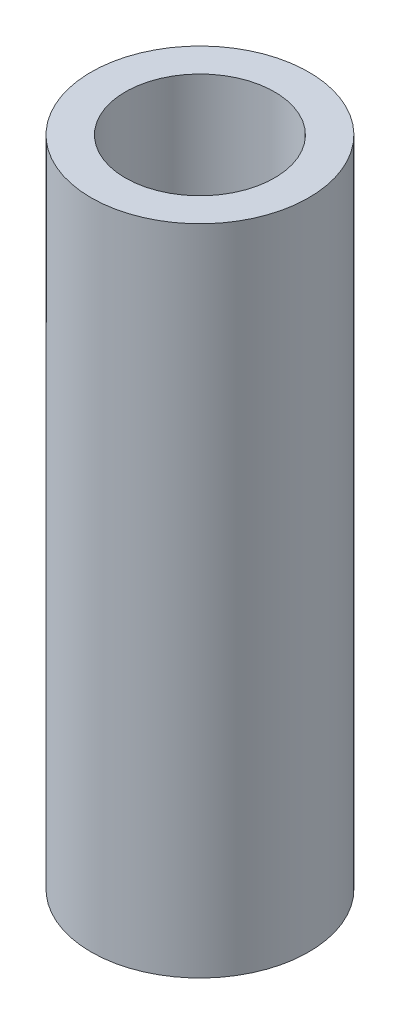
ISO-10303-21;
HEADER;
FILE_DESCRIPTION(('STEP AP214'),'2;1');
FILE_NAME('part.step','',(''),(''),'','','');
FILE_SCHEMA(('AUTOMOTIVE_DESIGN { 1 0 10303 214 1 1 1 1 }'));
ENDSEC;
DATA;
#1=APPLICATION_CONTEXT('core data for automotive mechanical design processes');
#2=APPLICATION_PROTOCOL_DEFINITION('international standard','automotive_design',2000,#1);
#3=PRODUCT_CONTEXT('',#1,'mechanical');
#4=PRODUCT('Part','Part','',(#3));
#5=PRODUCT_RELATED_PRODUCT_CATEGORY('part','',(#4));
#6=PRODUCT_DEFINITION_FORMATION('','',#4);
#7=PRODUCT_DEFINITION_CONTEXT('part definition',#1,'design');
#8=PRODUCT_DEFINITION('design','',#6,#7);
#9=PRODUCT_DEFINITION_SHAPE('','',#8);
#10=(LENGTH_UNIT() NAMED_UNIT(*) SI_UNIT(.MILLI.,.METRE.));
#11=(NAMED_UNIT(*) PLANE_ANGLE_UNIT() SI_UNIT($,.RADIAN.));
#12=(NAMED_UNIT(*) SI_UNIT($,.STERADIAN.) SOLID_ANGLE_UNIT());
#13=UNCERTAINTY_MEASURE_WITH_UNIT(LENGTH_MEASURE(1.E-05),#10,'distance_accuracy_value','');
#14=(GEOMETRIC_REPRESENTATION_CONTEXT(3) GLOBAL_UNCERTAINTY_ASSIGNED_CONTEXT((#13)) GLOBAL_UNIT_ASSIGNED_CONTEXT((#10,
#11,#12)) REPRESENTATION_CONTEXT('',''));
#15=CARTESIAN_POINT('',(0.,0.,0.));
#16=DIRECTION('',(0.,0.,1.));
#17=DIRECTION('',(1.,0.,0.));
#18=AXIS2_PLACEMENT_3D('',#15,#16,#17);
#19=CARTESIAN_POINT('',(0.,28.575,0.));
#20=DIRECTION('',(0.,1.,0.));
#21=DIRECTION('',(0.,0.,1.));
#22=AXIS2_PLACEMENT_3D('',#19,#20,#21);
#23=PLANE('',#22);
#24=CARTESIAN_POINT('',(0.,28.575,0.));
#25=DIRECTION('',(0.,1.,0.));
#26=DIRECTION('',(0.,0.,1.));
#27=AXIS2_PLACEMENT_3D('',#24,#25,#26);
#28=CIRCLE('',#27,4.7625);
#29=CARTESIAN_POINT('',(0.,28.575,4.7625));
#30=VERTEX_POINT('',#29);
#31=EDGE_CURVE('E10',#30,#30,#28,.T.);
#32=ORIENTED_EDGE('',*,*,#31,.T.);
#33=EDGE_LOOP('',(#32));
#34=FACE_BOUND('',#33,.T.);
#35=CARTESIAN_POINT('',(0.,28.575,0.));
#36=DIRECTION('',(0.,1.,0.));
#37=DIRECTION('',(0.,0.,1.));
#38=AXIS2_PLACEMENT_3D('',#35,#36,#37);
#39=CIRCLE('',#38,3.2639);
#40=CARTESIAN_POINT('',(0.,28.575,3.2639));
#41=VERTEX_POINT('',#40);
#42=EDGE_CURVE('E50',#41,#41,#39,.T.);
#43=ORIENTED_EDGE('',*,*,#42,.F.);
#44=EDGE_LOOP('',(#43));
#45=FACE_BOUND('',#44,.T.);
#46=ADVANCED_FACE('F37',(#34,#45),#23,.T.);
#47=CARTESIAN_POINT('',(0.,0.,0.));
#48=DIRECTION('',(0.,1.,0.));
#49=DIRECTION('',(0.,0.,1.));
#50=AXIS2_PLACEMENT_3D('',#47,#48,#49);
#51=PLANE('',#50);
#52=CARTESIAN_POINT('',(0.,0.,0.));
#53=DIRECTION('',(0.,1.,0.));
#54=DIRECTION('',(0.,0.,1.));
#55=AXIS2_PLACEMENT_3D('',#52,#53,#54);
#56=CIRCLE('',#55,4.7625);
#57=CARTESIAN_POINT('',(0.,0.,4.7625));
#58=VERTEX_POINT('',#57);
#59=EDGE_CURVE('E41',#58,#58,#56,.T.);
#60=ORIENTED_EDGE('',*,*,#59,.F.);
#61=EDGE_LOOP('',(#60));
#62=FACE_BOUND('',#61,.T.);
#63=CARTESIAN_POINT('',(0.,0.,0.));
#64=DIRECTION('',(0.,1.,0.));
#65=DIRECTION('',(0.,0.,1.));
#66=AXIS2_PLACEMENT_3D('',#63,#64,#65);
#67=CIRCLE('',#66,3.2639);
#68=CARTESIAN_POINT('',(0.,0.,3.2639));
#69=VERTEX_POINT('',#68);
#70=EDGE_CURVE('E52',#69,#69,#67,.T.);
#71=ORIENTED_EDGE('',*,*,#70,.T.);
#72=EDGE_LOOP('',(#71));
#73=FACE_BOUND('',#72,.T.);
#74=ADVANCED_FACE('F64',(#62,#73),#51,.F.);
#75=CARTESIAN_POINT('',(0.,28.575,0.));
#76=DIRECTION('',(0.,-1.,0.));
#77=DIRECTION('',(0.,0.,-1.));
#78=AXIS2_PLACEMENT_3D('',#75,#76,#77);
#79=CYLINDRICAL_SURFACE('',#78,4.7625);
#80=ORIENTED_EDGE('',*,*,#31,.F.);
#81=EDGE_LOOP('',(#80));
#82=FACE_BOUND('',#81,.T.);
#83=ORIENTED_EDGE('',*,*,#59,.T.);
#84=EDGE_LOOP('',(#83));
#85=FACE_BOUND('',#84,.T.);
#86=ADVANCED_FACE('F39',(#82,#85),#79,.T.);
#87=CARTESIAN_POINT('',(0.,28.575,0.));
#88=DIRECTION('',(0.,-1.,0.));
#89=DIRECTION('',(0.,0.,-1.));
#90=AXIS2_PLACEMENT_3D('',#87,#88,#89);
#91=CYLINDRICAL_SURFACE('',#90,3.2639);
#92=ORIENTED_EDGE('',*,*,#42,.T.);
#93=EDGE_LOOP('',(#92));
#94=FACE_BOUND('',#93,.T.);
#95=ORIENTED_EDGE('',*,*,#70,.F.);
#96=EDGE_LOOP('',(#95));
#97=FACE_BOUND('',#96,.T.);
#98=ADVANCED_FACE('F60',(#94,#97),#91,.F.);
#99=CLOSED_SHELL('',(#46,#74,#86,#98));
#100=MANIFOLD_SOLID_BREP('B2',#99);
#101=ADVANCED_BREP_SHAPE_REPRESENTATION('',(#18,#100),#14);
#102=SHAPE_DEFINITION_REPRESENTATION(#9,#101);
ENDSEC;
END-ISO-10303-21;
